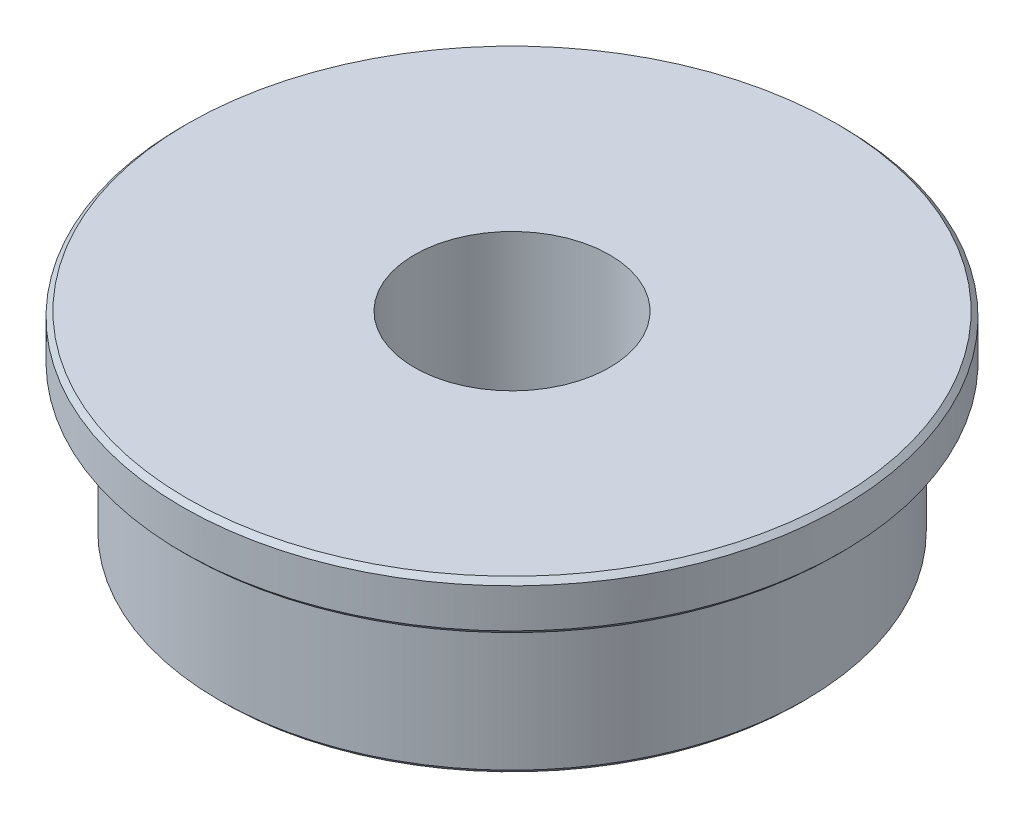
ISO-10303-21;
HEADER;
FILE_DESCRIPTION(('STEP AP214'),'2;1');
FILE_NAME('part.step','',(''),(''),'','','');
FILE_SCHEMA(('AUTOMOTIVE_DESIGN { 1 0 10303 214 1 1 1 1 }'));
ENDSEC;
DATA;
#1=APPLICATION_CONTEXT('core data for automotive mechanical design processes');
#2=APPLICATION_PROTOCOL_DEFINITION('international standard','automotive_design',2000,#1);
#3=PRODUCT_CONTEXT('',#1,'mechanical');
#4=PRODUCT('Part','Part','',(#3));
#5=PRODUCT_RELATED_PRODUCT_CATEGORY('part','',(#4));
#6=PRODUCT_DEFINITION_FORMATION('','',#4);
#7=PRODUCT_DEFINITION_CONTEXT('part definition',#1,'design');
#8=PRODUCT_DEFINITION('design','',#6,#7);
#9=PRODUCT_DEFINITION_SHAPE('','',#8);
#10=(LENGTH_UNIT() NAMED_UNIT(*) SI_UNIT(.MILLI.,.METRE.));
#11=(NAMED_UNIT(*) PLANE_ANGLE_UNIT() SI_UNIT($,.RADIAN.));
#12=(NAMED_UNIT(*) SI_UNIT($,.STERADIAN.) SOLID_ANGLE_UNIT());
#13=UNCERTAINTY_MEASURE_WITH_UNIT(LENGTH_MEASURE(1.E-05),#10,'distance_accuracy_value','');
#14=(GEOMETRIC_REPRESENTATION_CONTEXT(3) GLOBAL_UNCERTAINTY_ASSIGNED_CONTEXT((#13)) GLOBAL_UNIT_ASSIGNED_CONTEXT((#10,
#11,#12)) REPRESENTATION_CONTEXT('',''));
#15=CARTESIAN_POINT('',(0.,0.,0.));
#16=DIRECTION('',(0.,0.,1.));
#17=DIRECTION('',(1.,0.,0.));
#18=AXIS2_PLACEMENT_3D('',#15,#16,#17);
#19=CARTESIAN_POINT('',(6.,0.,0.));
#20=DIRECTION('',(0.,-1.,0.));
#21=DIRECTION('',(0.,0.,-1.));
#22=AXIS2_PLACEMENT_3D('',#19,#20,#21);
#23=PLANE('',#22);
#24=CARTESIAN_POINT('',(0.,0.,0.));
#25=DIRECTION('',(0.,-1.,0.));
#26=DIRECTION('',(0.,0.,-1.));
#27=AXIS2_PLACEMENT_3D('',#24,#25,#26);
#28=CIRCLE('',#27,5.89999999999999);
#29=CARTESIAN_POINT('',(0.,0.,-5.89999999999999));
#30=VERTEX_POINT('',#29);
#31=EDGE_CURVE('E58',#30,#30,#28,.T.);
#32=ORIENTED_EDGE('',*,*,#31,.T.);
#33=EDGE_LOOP('',(#32));
#34=FACE_BOUND('',#33,.T.);
#35=CARTESIAN_POINT('',(0.,0.,0.));
#36=DIRECTION('',(0.,-1.,0.));
#37=DIRECTION('',(0.,0.,-1.));
#38=AXIS2_PLACEMENT_3D('',#35,#36,#37);
#39=CIRCLE('',#38,2.);
#40=CARTESIAN_POINT('',(0.,0.,-2.));
#41=VERTEX_POINT('',#40);
#42=EDGE_CURVE('E61',#41,#41,#39,.T.);
#43=ORIENTED_EDGE('',*,*,#42,.F.);
#44=EDGE_LOOP('',(#43));
#45=FACE_BOUND('',#44,.T.);
#46=ADVANCED_FACE('F34',(#34,#45),#23,.T.);
#47=CARTESIAN_POINT('',(0.,0.,0.));
#48=DIRECTION('',(0.,-1.,0.));
#49=DIRECTION('',(0.,0.,-1.));
#50=AXIS2_PLACEMENT_3D('',#47,#48,#49);
#51=CYLINDRICAL_SURFACE('',#50,2.);
#52=ORIENTED_EDGE('',*,*,#42,.T.);
#53=EDGE_LOOP('',(#52));
#54=FACE_BOUND('',#53,.T.);
#55=CARTESIAN_POINT('',(0.,4.,0.));
#56=DIRECTION('',(0.,-1.,0.));
#57=DIRECTION('',(0.,0.,-1.));
#58=AXIS2_PLACEMENT_3D('',#55,#56,#57);
#59=CIRCLE('',#58,2.);
#60=CARTESIAN_POINT('',(0.,4.,-2.));
#61=VERTEX_POINT('',#60);
#62=EDGE_CURVE('E64',#61,#61,#59,.T.);
#63=ORIENTED_EDGE('',*,*,#62,.F.);
#64=EDGE_LOOP('',(#63));
#65=FACE_BOUND('',#64,.T.);
#66=ADVANCED_FACE('F88',(#54,#65),#51,.F.);
#67=CARTESIAN_POINT('',(2.,4.,0.));
#68=DIRECTION('',(0.,1.,0.));
#69=DIRECTION('',(0.,0.,1.));
#70=AXIS2_PLACEMENT_3D('',#67,#68,#69);
#71=PLANE('',#70);
#72=CARTESIAN_POINT('',(0.,4.,0.));
#73=DIRECTION('',(0.,1.,0.));
#74=DIRECTION('',(0.,0.,1.));
#75=AXIS2_PLACEMENT_3D('',#72,#73,#74);
#76=CIRCLE('',#75,6.65);
#77=CARTESIAN_POINT('',(0.,4.,6.65));
#78=VERTEX_POINT('',#77);
#79=EDGE_CURVE('E10',#78,#78,#76,.T.);
#80=ORIENTED_EDGE('',*,*,#79,.T.);
#81=EDGE_LOOP('',(#80));
#82=FACE_BOUND('',#81,.T.);
#83=ORIENTED_EDGE('',*,*,#62,.T.);
#84=EDGE_LOOP('',(#83));
#85=FACE_BOUND('',#84,.T.);
#86=ADVANCED_FACE('F85',(#82,#85),#71,.T.);
#87=CARTESIAN_POINT('',(0.,0.,0.));
#88=DIRECTION('',(0.,-1.,0.));
#89=DIRECTION('',(0.,0.,-1.));
#90=AXIS2_PLACEMENT_3D('',#87,#88,#89);
#91=CYLINDRICAL_SURFACE('',#90,6.75);
#92=CARTESIAN_POINT('',(0.,3.1,0.));
#93=DIRECTION('',(0.,-1.,0.));
#94=DIRECTION('',(0.,0.,-1.));
#95=AXIS2_PLACEMENT_3D('',#92,#93,#94);
#96=CIRCLE('',#95,6.75);
#97=CARTESIAN_POINT('',(0.,3.1,-6.75));
#98=VERTEX_POINT('',#97);
#99=EDGE_CURVE('E42',#98,#98,#96,.F.);
#100=ORIENTED_EDGE('',*,*,#99,.T.);
#101=EDGE_LOOP('',(#100));
#102=FACE_BOUND('',#101,.T.);
#103=CARTESIAN_POINT('',(0.,3.9,0.));
#104=DIRECTION('',(0.,1.,0.));
#105=DIRECTION('',(0.,0.,1.));
#106=AXIS2_PLACEMENT_3D('',#103,#104,#105);
#107=CIRCLE('',#106,6.75);
#108=CARTESIAN_POINT('',(0.,3.9,6.75));
#109=VERTEX_POINT('',#108);
#110=EDGE_CURVE('E46',#109,#109,#107,.F.);
#111=ORIENTED_EDGE('',*,*,#110,.T.);
#112=EDGE_LOOP('',(#111));
#113=FACE_BOUND('',#112,.T.);
#114=ADVANCED_FACE('F75',(#102,#113),#91,.T.);
#115=CARTESIAN_POINT('',(6.75,3.,0.));
#116=DIRECTION('',(0.,-1.,0.));
#117=DIRECTION('',(0.,0.,-1.));
#118=AXIS2_PLACEMENT_3D('',#115,#116,#117);
#119=PLANE('',#118);
#120=CARTESIAN_POINT('',(0.,3.,0.));
#121=DIRECTION('',(0.,-1.,0.));
#122=DIRECTION('',(0.,0.,-1.));
#123=AXIS2_PLACEMENT_3D('',#120,#121,#122);
#124=CIRCLE('',#123,6.64999999999999);
#125=CARTESIAN_POINT('',(0.,3.,-6.64999999999999));
#126=VERTEX_POINT('',#125);
#127=EDGE_CURVE('E50',#126,#126,#124,.T.);
#128=ORIENTED_EDGE('',*,*,#127,.T.);
#129=EDGE_LOOP('',(#128));
#130=FACE_BOUND('',#129,.T.);
#131=CARTESIAN_POINT('',(0.,3.,0.));
#132=DIRECTION('',(0.,-1.,0.));
#133=DIRECTION('',(0.,0.,-1.));
#134=AXIS2_PLACEMENT_3D('',#131,#132,#133);
#135=CIRCLE('',#134,6.);
#136=CARTESIAN_POINT('',(0.,3.,-6.));
#137=VERTEX_POINT('',#136);
#138=EDGE_CURVE('E67',#137,#137,#135,.T.);
#139=ORIENTED_EDGE('',*,*,#138,.F.);
#140=EDGE_LOOP('',(#139));
#141=FACE_BOUND('',#140,.T.);
#142=ADVANCED_FACE('F73',(#130,#141),#119,.T.);
#143=CARTESIAN_POINT('',(0.,0.,0.));
#144=DIRECTION('',(0.,-1.,0.));
#145=DIRECTION('',(0.,0.,-1.));
#146=AXIS2_PLACEMENT_3D('',#143,#144,#145);
#147=CYLINDRICAL_SURFACE('',#146,6.);
#148=CARTESIAN_POINT('',(0.,0.100000000000007,0.));
#149=DIRECTION('',(0.,-1.,0.));
#150=DIRECTION('',(0.,0.,-1.));
#151=AXIS2_PLACEMENT_3D('',#148,#149,#150);
#152=CIRCLE('',#151,6.);
#153=CARTESIAN_POINT('',(0.,0.100000000000007,-6.));
#154=VERTEX_POINT('',#153);
#155=EDGE_CURVE('E55',#154,#154,#152,.F.);
#156=ORIENTED_EDGE('',*,*,#155,.T.);
#157=EDGE_LOOP('',(#156));
#158=FACE_BOUND('',#157,.T.);
#159=ORIENTED_EDGE('',*,*,#138,.T.);
#160=EDGE_LOOP('',(#159));
#161=FACE_BOUND('',#160,.T.);
#162=ADVANCED_FACE('F71',(#158,#161),#147,.T.);
#163=CARTESIAN_POINT('',(0.,0.,0.));
#164=DIRECTION('',(0.,1.,0.));
#165=DIRECTION('',(0.,0.,1.));
#166=AXIS2_PLACEMENT_3D('',#163,#164,#165);
#167=CONICAL_SURFACE('',#166,5.89999999999999,0.785398163397444);
#168=ORIENTED_EDGE('',*,*,#155,.F.);
#169=EDGE_LOOP('',(#168));
#170=FACE_BOUND('',#169,.T.);
#171=ORIENTED_EDGE('',*,*,#31,.F.);
#172=EDGE_LOOP('',(#171));
#173=FACE_BOUND('',#172,.T.);
#174=ADVANCED_FACE('F82',(#170,#173),#167,.T.);
#175=CARTESIAN_POINT('',(0.,3.,0.));
#176=DIRECTION('',(0.,1.,0.));
#177=DIRECTION('',(0.,0.,1.));
#178=AXIS2_PLACEMENT_3D('',#175,#176,#177);
#179=CONICAL_SURFACE('',#178,6.64999999999999,0.785398163397461);
#180=ORIENTED_EDGE('',*,*,#99,.F.);
#181=EDGE_LOOP('',(#180));
#182=FACE_BOUND('',#181,.T.);
#183=ORIENTED_EDGE('',*,*,#127,.F.);
#184=EDGE_LOOP('',(#183));
#185=FACE_BOUND('',#184,.T.);
#186=ADVANCED_FACE('F104',(#182,#185),#179,.T.);
#187=CARTESIAN_POINT('',(0.,3.9,0.));
#188=DIRECTION('',(0.,-1.,0.));
#189=DIRECTION('',(0.,0.,-1.));
#190=AXIS2_PLACEMENT_3D('',#187,#188,#189);
#191=CONICAL_SURFACE('',#190,6.75,0.78539816339744);
#192=ORIENTED_EDGE('',*,*,#79,.F.);
#193=EDGE_LOOP('',(#192));
#194=FACE_BOUND('',#193,.T.);
#195=ORIENTED_EDGE('',*,*,#110,.F.);
#196=EDGE_LOOP('',(#195));
#197=FACE_BOUND('',#196,.T.);
#198=ADVANCED_FACE('F37',(#194,#197),#191,.T.);
#199=CLOSED_SHELL('',(#46,#66,#86,#114,#142,#162,#174,#186,#198));
#200=MANIFOLD_SOLID_BREP('B2',#199);
#201=ADVANCED_BREP_SHAPE_REPRESENTATION('',(#18,#200),#14);
#202=SHAPE_DEFINITION_REPRESENTATION(#9,#201);
ENDSEC;
END-ISO-10303-21;
